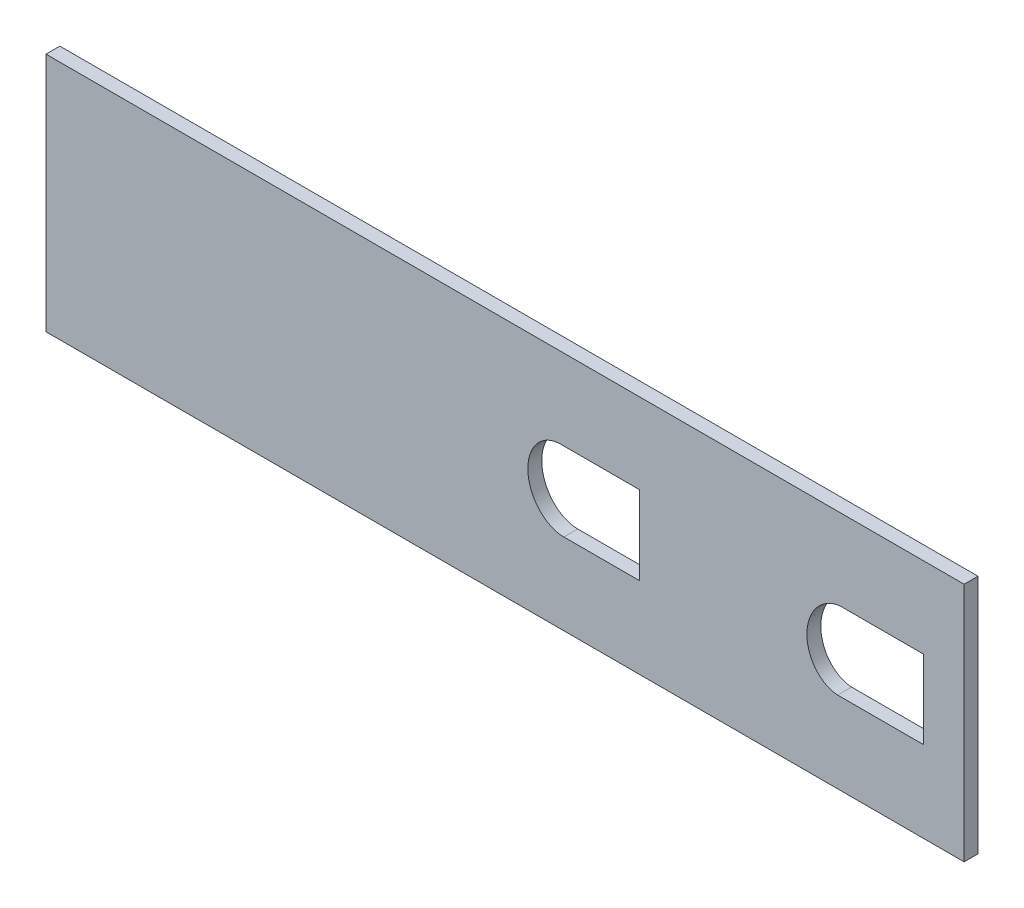
ISO-10303-21;
HEADER;
FILE_DESCRIPTION(('STEP AP214'),'2;1');
FILE_NAME('part.step','',(''),(''),'','','');
FILE_SCHEMA(('AUTOMOTIVE_DESIGN { 1 0 10303 214 1 1 1 1 }'));
ENDSEC;
DATA;
#1=APPLICATION_CONTEXT('core data for automotive mechanical design processes');
#2=APPLICATION_PROTOCOL_DEFINITION('international standard','automotive_design',2000,#1);
#3=PRODUCT_CONTEXT('',#1,'mechanical');
#4=PRODUCT('Part','Part','',(#3));
#5=PRODUCT_RELATED_PRODUCT_CATEGORY('part','',(#4));
#6=PRODUCT_DEFINITION_FORMATION('','',#4);
#7=PRODUCT_DEFINITION_CONTEXT('part definition',#1,'design');
#8=PRODUCT_DEFINITION('design','',#6,#7);
#9=PRODUCT_DEFINITION_SHAPE('','',#8);
#10=(LENGTH_UNIT() NAMED_UNIT(*) SI_UNIT(.MILLI.,.METRE.));
#11=(NAMED_UNIT(*) PLANE_ANGLE_UNIT() SI_UNIT($,.RADIAN.));
#12=(NAMED_UNIT(*) SI_UNIT($,.STERADIAN.) SOLID_ANGLE_UNIT());
#13=UNCERTAINTY_MEASURE_WITH_UNIT(LENGTH_MEASURE(1.E-05),#10,'distance_accuracy_value','');
#14=(GEOMETRIC_REPRESENTATION_CONTEXT(3) GLOBAL_UNCERTAINTY_ASSIGNED_CONTEXT((#13)) GLOBAL_UNIT_ASSIGNED_CONTEXT((#10,
#11,#12)) REPRESENTATION_CONTEXT('',''));
#15=CARTESIAN_POINT('',(0.,0.,0.));
#16=DIRECTION('',(0.,0.,1.));
#17=DIRECTION('',(1.,0.,0.));
#18=AXIS2_PLACEMENT_3D('',#15,#16,#17);
#19=CARTESIAN_POINT('',(0.,0.,3.175));
#20=DIRECTION('',(0.,0.,1.));
#21=DIRECTION('',(1.,0.,0.));
#22=AXIS2_PLACEMENT_3D('',#19,#20,#21);
#23=PLANE('',#22);
#24=DIRECTION('',(0.,-1.,0.));
#25=VECTOR('',#24,1.);
#26=CARTESIAN_POINT('',(-366.588298269724,9.05831085311452,3.175));
#27=LINE('',#26,#25);
#28=CARTESIAN_POINT('',(-366.588298269724,9.05831085311452,3.175));
#29=VERTEX_POINT('',#28);
#30=CARTESIAN_POINT('',(-366.588298269724,-45.9416891468855,3.175));
#31=VERTEX_POINT('',#30);
#32=EDGE_CURVE('E230',#29,#31,#27,.T.);
#33=ORIENTED_EDGE('',*,*,#32,.T.);
#34=DIRECTION('',(1.,0.,0.));
#35=VECTOR('',#34,1.);
#36=CARTESIAN_POINT('',(-366.588298269724,-45.9416891468855,3.175));
#37=LINE('',#36,#35);
#38=CARTESIAN_POINT('',(-156.588298269724,-45.9416891468855,3.175));
#39=VERTEX_POINT('',#38);
#40=EDGE_CURVE('E243',#31,#39,#37,.T.);
#41=ORIENTED_EDGE('',*,*,#40,.T.);
#42=DIRECTION('',(0.,1.,0.));
#43=VECTOR('',#42,1.);
#44=CARTESIAN_POINT('',(-156.588298269724,9.05831085311455,3.175));
#45=LINE('',#44,#43);
#46=CARTESIAN_POINT('',(-156.588298269724,9.05831085311455,3.175));
#47=VERTEX_POINT('',#46);
#48=EDGE_CURVE('E224',#39,#47,#45,.T.);
#49=ORIENTED_EDGE('',*,*,#48,.T.);
#50=DIRECTION('',(-1.,0.,0.));
#51=VECTOR('',#50,1.);
#52=CARTESIAN_POINT('',(-366.588298269724,9.05831085311452,3.175));
#53=LINE('',#52,#51);
#54=EDGE_CURVE('E237',#47,#29,#53,.T.);
#55=ORIENTED_EDGE('',*,*,#54,.T.);
#56=EDGE_LOOP('',(#33,#41,#49,#55));
#57=FACE_BOUND('',#56,.T.);
#58=DIRECTION('',(1.,0.,0.));
#59=VECTOR('',#58,1.);
#60=CARTESIAN_POINT('',(-165.825906921968,-27.3596825358783,3.175));
#61=LINE('',#60,#59);
#62=CARTESIAN_POINT('',(-185.498112528018,-27.3596825358783,3.175));
#63=VERTEX_POINT('',#62);
#64=CARTESIAN_POINT('',(-165.825906921968,-27.3596825358783,3.175));
#65=VERTEX_POINT('',#64);
#66=EDGE_CURVE('E175',#63,#65,#61,.T.);
#67=ORIENTED_EDGE('',*,*,#66,.F.);
#68=CARTESIAN_POINT('',(-183.82600512815,-9.43762627900424,3.175));
#69=CARTESIAN_POINT('',(-184.381626607093,-9.3976877190397,3.175));
#70=CARTESIAN_POINT('',(-184.930515995652,-9.42483503394392,3.175));
#71=CARTESIAN_POINT('',(-186.015461991202,-9.60700946475767,3.175));
#72=CARTESIAN_POINT('',(-186.55468923459,-9.76487740277179,3.175));
#73=CARTESIAN_POINT('',(-187.316224975167,-10.0827047791657,3.175));
#74=CARTESIAN_POINT('',(-187.563814733712,-10.2023326238669,3.175));
#75=CARTESIAN_POINT('',(-188.046959470164,-10.4679172917623,3.175));
#76=CARTESIAN_POINT('',(-188.283591246519,-10.6146532163173,3.175));
#77=CARTESIAN_POINT('',(-188.967244504561,-11.0880994772463,3.175));
#78=CARTESIAN_POINT('',(-189.385834671062,-11.4451532324852,3.175));
#79=CARTESIAN_POINT('',(-190.155876140981,-12.2340640435901,3.175));
#80=CARTESIAN_POINT('',(-190.507940945727,-12.6685060868446,3.175));
#81=CARTESIAN_POINT('',(-191.1243492632,-13.5796209281931,3.175));
#82=CARTESIAN_POINT('',(-191.392257861304,-14.0594522395769,3.175));
#83=CARTESIAN_POINT('',(-191.735229160199,-14.8146752788922,3.175));
#84=CARTESIAN_POINT('',(-191.839717206272,-15.0728043894434,3.175));
#85=CARTESIAN_POINT('',(-192.025673908438,-15.5922309114728,3.175));
#86=CARTESIAN_POINT('',(-192.107659089232,-15.8545617787205,3.175));
#87=CARTESIAN_POINT('',(-192.321609274542,-16.6491752414127,3.175));
#88=CARTESIAN_POINT('',(-192.421750283607,-17.1890355134204,3.175));
#89=CARTESIAN_POINT('',(-192.508320776969,-18.0139796147588,3.175));
#90=CARTESIAN_POINT('',(-192.5264496794,-18.2916278624961,3.175));
#91=CARTESIAN_POINT('',(-192.540341709365,-18.8424309209239,3.175));
#92=CARTESIAN_POINT('',(-192.536260586708,-19.1167856485607,3.175));
#93=CARTESIAN_POINT('',(-192.490788713883,-19.9366954633639,3.175));
#94=CARTESIAN_POINT('',(-192.416446167164,-20.4791224502265,3.175));
#95=CARTESIAN_POINT('',(-192.234051872117,-21.2860342765934,3.175));
#96=CARTESIAN_POINT('',(-192.160881012469,-21.5551925624767,3.175));
#97=CARTESIAN_POINT('',(-191.992478643506,-22.0811289126585,3.175));
#98=CARTESIAN_POINT('',(-191.897215209672,-22.3386327619648,3.175));
#99=CARTESIAN_POINT('',(-191.578152340301,-23.0947089408419,3.175));
#100=CARTESIAN_POINT('',(-191.321465438144,-23.5770361265796,3.175));
#101=CARTESIAN_POINT('',(-190.864095629699,-24.2647939961027,3.175));
#102=CARTESIAN_POINT('',(-190.698255397334,-24.4894667964201,3.175));
#103=CARTESIAN_POINT('',(-190.347004112485,-24.9172218288641,3.175));
#104=CARTESIAN_POINT('',(-190.1618794335,-25.1203290672043,3.175));
#105=CARTESIAN_POINT('',(-189.577727685681,-25.6970217949708,3.175));
#106=CARTESIAN_POINT('',(-189.150303694519,-26.0384100460214,3.175));
#107=CARTESIAN_POINT('',(-188.444997142431,-26.4777340100719,3.175));
#108=CARTESIAN_POINT('',(-188.199013121392,-26.6115925506904,3.175));
#109=CARTESIAN_POINT('',(-187.699838217374,-26.8456248371998,3.175));
#110=CARTESIAN_POINT('',(-187.189859793686,-27.0483935371301,3.175));
#111=CARTESIAN_POINT('',(-186.658261328081,-27.1885974366089,3.175));
#112=CARTESIAN_POINT('',(-186.115554077769,-27.2966543633341,3.175));
#113=CARTESIAN_POINT('',(-185.837627103115,-27.3344436795835,3.175));
#114=CARTESIAN_POINT('',(-185.540644375799,-27.3567769033788,3.175));
#115=CARTESIAN_POINT('',(-185.51937734486,-27.3582786059454,3.175));
#116=CARTESIAN_POINT('',(-185.498112528018,-27.3596825358783,3.175));
#117=B_SPLINE_CURVE_WITH_KNOTS('',3,(#68,#69,#70,#71,#72,#73,#74,#75,#76,#77,#78,#79,#80,#81,
#82,#83,#84,#85,#86,#87,#88,#89,#90,#91,#92,#93,#94,#95,#96,#97,#98,#99,#100,#101,#102,#103,
#104,#105,#106,#107,#108,#109,#110,#111,#112,#113,#114,#115,#116),.UNSPECIFIED.,.F.,.F.,(4,2,2,
2,2,2,2,2,2,2,2,2,2,2,2,2,2,2,2,2,2,1,2,2,4),(0.,0.0312499999999989,0.0624999999999977,
0.0781249999999973,0.093749999999997,0.124999999999997,0.156249999999998,0.187499999999998,
0.203124999999999,0.218749999999999,0.25,0.265625000000001,0.281250000000001,0.312500000000002,
0.328125000000002,0.343750000000003,0.375000000000005,0.390625000000005,0.406250000000006,
0.437500000000008,0.453125000000008,0.468750000000009,0.484375000000009,0.50000000000001,
0.501205352540777),.UNSPECIFIED.);
#118=CARTESIAN_POINT('',(-183.82600512815,-9.43762627900424,3.175));
#119=VERTEX_POINT('',#118);
#120=EDGE_CURVE('E170',#119,#63,#117,.T.);
#121=ORIENTED_EDGE('',*,*,#120,.F.);
#122=DIRECTION('',(-1.,0.,0.));
#123=VECTOR('',#122,1.);
#124=CARTESIAN_POINT('',(-183.82600512815,-9.43762627900424,3.175));
#125=LINE('',#124,#123);
#126=CARTESIAN_POINT('',(-165.825906921968,-9.43762627900424,3.175));
#127=VERTEX_POINT('',#126);
#128=EDGE_CURVE('E265',#127,#119,#125,.T.);
#129=ORIENTED_EDGE('',*,*,#128,.F.);
#130=DIRECTION('',(0.,1.,0.));
#131=VECTOR('',#130,1.);
#132=CARTESIAN_POINT('',(-165.825906921968,-9.43762627900424,3.175));
#133=LINE('',#132,#131);
#134=EDGE_CURVE('E262',#65,#127,#133,.T.);
#135=ORIENTED_EDGE('',*,*,#134,.F.);
#136=EDGE_LOOP('',(#67,#121,#129,#135));
#137=FACE_BOUND('',#136,.T.);
#138=DIRECTION('',(1.,0.,0.));
#139=VECTOR('',#138,1.);
#140=CARTESIAN_POINT('',(-230.842639606397,-27.3595694212988,3.175));
#141=LINE('',#140,#139);
#142=CARTESIAN_POINT('',(-248.122030425749,-27.3595694212988,3.175));
#143=VERTEX_POINT('',#142);
#144=CARTESIAN_POINT('',(-230.842639606397,-27.3595694212988,3.175));
#145=VERTEX_POINT('',#144);
#146=EDGE_CURVE('E134',#143,#145,#141,.T.);
#147=ORIENTED_EDGE('',*,*,#146,.F.);
#148=CARTESIAN_POINT('',(-248.842639606397,-9.34526811980848,3.175));
#149=CARTESIAN_POINT('',(-249.008492971074,-9.34526811980872,3.175));
#150=CARTESIAN_POINT('',(-249.174528911602,-9.35121721735225,3.175));
#151=CARTESIAN_POINT('',(-249.89789273651,-9.4031482934177,3.175));
#152=CARTESIAN_POINT('',(-250.439041217788,-9.5087913489933,3.175));
#153=CARTESIAN_POINT('',(-251.226902991406,-9.76427711693536,3.175));
#154=CARTESIAN_POINT('',(-251.486942339155,-9.86638963149958,3.175));
#155=CARTESIAN_POINT('',(-251.99189871818,-10.1008834673623,3.175));
#156=CARTESIAN_POINT('',(-252.478538382804,-10.3636674117562,3.175));
#157=CARTESIAN_POINT('',(-252.930635603864,-10.6798020529985,3.175));
#158=CARTESIAN_POINT('',(-253.365916766493,-11.0219090442841,3.175));
#159=CARTESIAN_POINT('',(-253.576181815946,-11.2070746349716,3.175));
#160=CARTESIAN_POINT('',(-254.170571266035,-11.7902063920366,3.175));
#161=CARTESIAN_POINT('',(-254.521054547173,-12.2164086816258,3.175));
#162=CARTESIAN_POINT('',(-254.984007031448,-12.9070637117029,3.175));
#163=CARTESIAN_POINT('',(-255.128207338842,-13.1469263186751,3.175));
#164=CARTESIAN_POINT('',(-255.391039984974,-13.6351319569444,3.175));
#165=CARTESIAN_POINT('',(-255.510280091706,-13.8842000215914,3.175));
#166=CARTESIAN_POINT('',(-255.833281598636,-14.6455619330882,3.175));
#167=CARTESIAN_POINT('',(-256.003111783134,-15.174210606256,3.175));
#168=CARTESIAN_POINT('',(-256.25011317257,-16.2584003483592,3.175));
#169=CARTESIAN_POINT('',(-256.325565616856,-16.804580712654,3.175));
#170=CARTESIAN_POINT('',(-256.371925399497,-17.6295327999595,3.175));
#171=CARTESIAN_POINT('',(-256.37617068135,-17.9054698319737,3.175));
#172=CARTESIAN_POINT('',(-256.362395822802,-18.4592371019221,3.175));
#173=CARTESIAN_POINT('',(-256.344221578809,-18.7379736365194,3.175));
#174=CARTESIAN_POINT('',(-256.257616037898,-19.5642495459919,3.175));
#175=CARTESIAN_POINT('',(-256.157308420975,-20.1052245457878,3.175));
#176=CARTESIAN_POINT('',(-255.942745345631,-20.9018166225572,3.175));
#177=CARTESIAN_POINT('',(-255.860495562724,-21.1648584371339,3.175));
#178=CARTESIAN_POINT('',(-255.673862588316,-21.6858075159791,3.175));
#179=CARTESIAN_POINT('',(-255.568906935041,-21.9448494274623,3.175));
#180=CARTESIAN_POINT('',(-255.224992288693,-22.70149766678,3.175));
#181=CARTESIAN_POINT('',(-254.956918189479,-23.1810175992367,3.175));
#182=CARTESIAN_POINT('',(-254.496021760085,-23.8625510991662,3.175));
#183=CARTESIAN_POINT('',(-254.332533090111,-24.0833999945349,3.175));
#184=CARTESIAN_POINT('',(-253.984921715629,-24.5118485417914,3.175));
#185=CARTESIAN_POINT('',(-253.799889309762,-24.7203724492883,3.175));
#186=CARTESIAN_POINT('',(-253.217915831476,-25.3179180375403,3.175));
#187=CARTESIAN_POINT('',(-252.799712481649,-25.674443478179,3.175));
#188=CARTESIAN_POINT('',(-252.125292420281,-26.1440051309579,3.175));
#189=CARTESIAN_POINT('',(-251.892576916941,-26.2895766409284,3.175));
#190=CARTESIAN_POINT('',(-251.410235401699,-26.5573085907726,3.175));
#191=CARTESIAN_POINT('',(-251.158897377964,-26.680166876181,3.175));
#192=CARTESIAN_POINT('',(-250.389777097534,-27.0046460570001,3.175));
#193=CARTESIAN_POINT('',(-249.862976161123,-27.1610192469186,3.175));
#194=CARTESIAN_POINT('',(-249.050989853004,-27.3026577365939,3.175));
#195=CARTESIAN_POINT('',(-248.776672466168,-27.3342793229584,3.175));
#196=CARTESIAN_POINT('',(-248.373197760273,-27.3561891893873,3.175));
#197=CARTESIAN_POINT('',(-248.247527215474,-27.3595694212988,3.175));
#198=CARTESIAN_POINT('',(-248.122030425748,-27.3595694212988,3.175));
#199=B_SPLINE_CURVE_WITH_KNOTS('',3,(#148,#149,#150,#151,#152,#153,#154,#155,#156,#157,#158,
#159,#160,#161,#162,#163,#164,#165,#166,#167,#168,#169,#170,#171,#172,#173,#174,#175,#176,#177,
#178,#179,#180,#181,#182,#183,#184,#185,#186,#187,#188,#189,#190,#191,#192,#193,#194,#195,#196,
#197,#198),.UNSPECIFIED.,.F.,.F.,(4,2,2,2,1,2,2,2,2,2,2,2,2,2,2,2,2,2,2,2,2,2,2,2,2,4),
(0.990687446676566,1.,1.03124999999999,1.04687499999998,1.06249999999998,1.07812499999997,
1.09374999999997,1.12499999999996,1.14062499999996,1.15624999999995,1.18749999999994,
1.21874999999994,1.23437499999993,1.24999999999993,1.28124999999992,1.29687499999992,
1.31249999999991,1.34374999999991,1.3593749999999,1.3749999999999,1.4062499999999,
1.42187499999989,1.43749999999989,1.46874999999989,1.4843749999999,1.49141188221113),.UNSPECIFIED.);
#200=CARTESIAN_POINT('',(-248.842639606397,-9.34526811980848,3.175));
#201=VERTEX_POINT('',#200);
#202=EDGE_CURVE('E126',#201,#143,#199,.T.);
#203=ORIENTED_EDGE('',*,*,#202,.F.);
#204=DIRECTION('',(-1.,0.,0.));
#205=VECTOR('',#204,1.);
#206=CARTESIAN_POINT('',(-248.842639606397,-9.34526811980848,3.175));
#207=LINE('',#206,#205);
#208=CARTESIAN_POINT('',(-230.842639606397,-9.34526811980848,3.175));
#209=VERTEX_POINT('',#208);
#210=EDGE_CURVE('E148',#209,#201,#207,.T.);
#211=ORIENTED_EDGE('',*,*,#210,.F.);
#212=DIRECTION('',(0.,1.,0.));
#213=VECTOR('',#212,1.);
#214=CARTESIAN_POINT('',(-230.842639606397,-9.34526811980848,3.175));
#215=LINE('',#214,#213);
#216=EDGE_CURVE('E146',#145,#209,#215,.T.);
#217=ORIENTED_EDGE('',*,*,#216,.F.);
#218=EDGE_LOOP('',(#147,#203,#211,#217));
#219=FACE_BOUND('',#218,.T.);
#220=ADVANCED_FACE('F37',(#57,#137,#219),#23,.T.);
#221=CARTESIAN_POINT('',(0.,0.,0.));
#222=DIRECTION('',(0.,0.,1.));
#223=DIRECTION('',(1.,0.,0.));
#224=AXIS2_PLACEMENT_3D('',#221,#222,#223);
#225=PLANE('',#224);
#226=CARTESIAN_POINT('',(-183.82600512815,-9.43762627900424,0.));
#227=CARTESIAN_POINT('',(-184.381626607093,-9.3976877190397,0.));
#228=CARTESIAN_POINT('',(-184.930515995652,-9.42483503394392,0.));
#229=CARTESIAN_POINT('',(-186.015461991202,-9.60700946475767,0.));
#230=CARTESIAN_POINT('',(-186.55468923459,-9.76487740277179,0.));
#231=CARTESIAN_POINT('',(-187.316224975167,-10.0827047791657,0.));
#232=CARTESIAN_POINT('',(-187.563814733712,-10.2023326238669,0.));
#233=CARTESIAN_POINT('',(-188.046959470164,-10.4679172917623,0.));
#234=CARTESIAN_POINT('',(-188.283591246519,-10.6146532163173,0.));
#235=CARTESIAN_POINT('',(-188.967244504561,-11.0880994772463,0.));
#236=CARTESIAN_POINT('',(-189.385834671062,-11.4451532324852,0.));
#237=CARTESIAN_POINT('',(-190.155876140981,-12.2340640435901,0.));
#238=CARTESIAN_POINT('',(-190.507940945727,-12.6685060868446,0.));
#239=CARTESIAN_POINT('',(-191.1243492632,-13.5796209281931,0.));
#240=CARTESIAN_POINT('',(-191.392257861304,-14.0594522395769,0.));
#241=CARTESIAN_POINT('',(-191.735229160199,-14.8146752788922,0.));
#242=CARTESIAN_POINT('',(-191.839717206272,-15.0728043894434,0.));
#243=CARTESIAN_POINT('',(-192.025673908438,-15.5922309114728,0.));
#244=CARTESIAN_POINT('',(-192.107659089232,-15.8545617787205,0.));
#245=CARTESIAN_POINT('',(-192.321609274542,-16.6491752414127,0.));
#246=CARTESIAN_POINT('',(-192.421750283607,-17.1890355134204,0.));
#247=CARTESIAN_POINT('',(-192.508320776969,-18.0139796147588,0.));
#248=CARTESIAN_POINT('',(-192.5264496794,-18.2916278624961,0.));
#249=CARTESIAN_POINT('',(-192.540341709365,-18.8424309209239,0.));
#250=CARTESIAN_POINT('',(-192.536260586708,-19.1167856485607,0.));
#251=CARTESIAN_POINT('',(-192.490788713883,-19.9366954633639,0.));
#252=CARTESIAN_POINT('',(-192.416446167164,-20.4791224502265,0.));
#253=CARTESIAN_POINT('',(-192.234051872117,-21.2860342765934,0.));
#254=CARTESIAN_POINT('',(-192.160881012469,-21.5551925624767,0.));
#255=CARTESIAN_POINT('',(-191.992478643506,-22.0811289126585,0.));
#256=CARTESIAN_POINT('',(-191.897215209672,-22.3386327619648,0.));
#257=CARTESIAN_POINT('',(-191.578152340301,-23.0947089408419,0.));
#258=CARTESIAN_POINT('',(-191.321465438144,-23.5770361265796,0.));
#259=CARTESIAN_POINT('',(-190.864095629699,-24.2647939961027,0.));
#260=CARTESIAN_POINT('',(-190.698255397334,-24.4894667964201,0.));
#261=CARTESIAN_POINT('',(-190.347004112485,-24.9172218288641,0.));
#262=CARTESIAN_POINT('',(-190.1618794335,-25.1203290672043,0.));
#263=CARTESIAN_POINT('',(-189.577727685681,-25.6970217949708,0.));
#264=CARTESIAN_POINT('',(-189.150303694519,-26.0384100460214,0.));
#265=CARTESIAN_POINT('',(-188.444997142431,-26.4777340100719,0.));
#266=CARTESIAN_POINT('',(-188.199013121392,-26.6115925506904,0.));
#267=CARTESIAN_POINT('',(-187.699838217374,-26.8456248371998,0.));
#268=CARTESIAN_POINT('',(-187.189859793686,-27.0483935371301,0.));
#269=CARTESIAN_POINT('',(-186.658261328081,-27.1885974366089,0.));
#270=CARTESIAN_POINT('',(-186.115554077769,-27.2966543633341,0.));
#271=CARTESIAN_POINT('',(-185.837627103115,-27.3344436795835,0.));
#272=CARTESIAN_POINT('',(-185.540644375799,-27.3567769033788,0.));
#273=CARTESIAN_POINT('',(-185.51937734486,-27.3582786059454,0.));
#274=CARTESIAN_POINT('',(-185.498112528018,-27.3596825358783,0.));
#275=B_SPLINE_CURVE_WITH_KNOTS('',3,(#226,#227,#228,#229,#230,#231,#232,#233,#234,#235,#236,
#237,#238,#239,#240,#241,#242,#243,#244,#245,#246,#247,#248,#249,#250,#251,#252,#253,#254,#255,
#256,#257,#258,#259,#260,#261,#262,#263,#264,#265,#266,#267,#268,#269,#270,#271,#272,#273,#274),
.UNSPECIFIED.,.F.,.F.,(4,2,2,2,2,2,2,2,2,2,2,2,2,2,2,2,2,2,2,2,2,1,2,2,4),(0.,
0.0312499999999989,0.0624999999999977,0.0781249999999973,0.093749999999997,0.124999999999997,
0.156249999999998,0.187499999999998,0.203124999999999,0.218749999999999,0.25,0.265625000000001,
0.281250000000001,0.312500000000002,0.328125000000002,0.343750000000003,0.375000000000005,
0.390625000000005,0.406250000000006,0.437500000000008,0.453125000000008,0.468750000000009,
0.484375000000009,0.50000000000001,0.501205352540777),.UNSPECIFIED.);
#276=CARTESIAN_POINT('',(-183.82600512815,-9.43762627900424,0.));
#277=VERTEX_POINT('',#276);
#278=CARTESIAN_POINT('',(-185.498112528018,-27.3596825358783,0.));
#279=VERTEX_POINT('',#278);
#280=EDGE_CURVE('E142',#277,#279,#275,.T.);
#281=ORIENTED_EDGE('',*,*,#280,.T.);
#282=DIRECTION('',(1.,0.,0.));
#283=VECTOR('',#282,1.);
#284=CARTESIAN_POINT('',(-165.825906921968,-27.3596825358783,0.));
#285=LINE('',#284,#283);
#286=CARTESIAN_POINT('',(-165.825906921968,-27.3596825358783,0.));
#287=VERTEX_POINT('',#286);
#288=EDGE_CURVE('E273',#279,#287,#285,.T.);
#289=ORIENTED_EDGE('',*,*,#288,.T.);
#290=DIRECTION('',(0.,1.,0.));
#291=VECTOR('',#290,1.);
#292=CARTESIAN_POINT('',(-165.825906921968,-9.43762627900424,0.));
#293=LINE('',#292,#291);
#294=CARTESIAN_POINT('',(-165.825906921968,-9.43762627900424,0.));
#295=VERTEX_POINT('',#294);
#296=EDGE_CURVE('E279',#287,#295,#293,.T.);
#297=ORIENTED_EDGE('',*,*,#296,.T.);
#298=DIRECTION('',(-1.,0.,0.));
#299=VECTOR('',#298,1.);
#300=CARTESIAN_POINT('',(-183.82600512815,-9.43762627900424,0.));
#301=LINE('',#300,#299);
#302=EDGE_CURVE('E176',#295,#277,#301,.T.);
#303=ORIENTED_EDGE('',*,*,#302,.T.);
#304=EDGE_LOOP('',(#281,#289,#297,#303));
#305=FACE_BOUND('',#304,.T.);
#306=DIRECTION('',(0.,-1.,0.));
#307=VECTOR('',#306,1.);
#308=CARTESIAN_POINT('',(-366.588298269724,9.05831085311452,0.));
#309=LINE('',#308,#307);
#310=CARTESIAN_POINT('',(-366.588298269724,9.05831085311452,0.));
#311=VERTEX_POINT('',#310);
#312=CARTESIAN_POINT('',(-366.588298269724,-45.9416891468855,0.));
#313=VERTEX_POINT('',#312);
#314=EDGE_CURVE('E220',#311,#313,#309,.T.);
#315=ORIENTED_EDGE('',*,*,#314,.F.);
#316=DIRECTION('',(-1.,0.,0.));
#317=VECTOR('',#316,1.);
#318=CARTESIAN_POINT('',(-366.588298269724,9.05831085311452,0.));
#319=LINE('',#318,#317);
#320=CARTESIAN_POINT('',(-156.588298269724,9.05831085311455,0.));
#321=VERTEX_POINT('',#320);
#322=EDGE_CURVE('E228',#321,#311,#319,.T.);
#323=ORIENTED_EDGE('',*,*,#322,.F.);
#324=DIRECTION('',(0.,1.,0.));
#325=VECTOR('',#324,1.);
#326=CARTESIAN_POINT('',(-156.588298269724,9.05831085311455,0.));
#327=LINE('',#326,#325);
#328=CARTESIAN_POINT('',(-156.588298269724,-45.9416891468855,0.));
#329=VERTEX_POINT('',#328);
#330=EDGE_CURVE('E219',#329,#321,#327,.T.);
#331=ORIENTED_EDGE('',*,*,#330,.F.);
#332=DIRECTION('',(1.,0.,0.));
#333=VECTOR('',#332,1.);
#334=CARTESIAN_POINT('',(-366.588298269724,-45.9416891468855,0.));
#335=LINE('',#334,#333);
#336=EDGE_CURVE('E211',#313,#329,#335,.T.);
#337=ORIENTED_EDGE('',*,*,#336,.F.);
#338=EDGE_LOOP('',(#315,#323,#331,#337));
#339=FACE_BOUND('',#338,.T.);
#340=CARTESIAN_POINT('',(-248.842639606397,-9.34526811980848,0.));
#341=CARTESIAN_POINT('',(-249.008492971074,-9.34526811980872,0.));
#342=CARTESIAN_POINT('',(-249.174528911602,-9.35121721735225,0.));
#343=CARTESIAN_POINT('',(-249.89789273651,-9.4031482934177,0.));
#344=CARTESIAN_POINT('',(-250.439041217788,-9.5087913489933,0.));
#345=CARTESIAN_POINT('',(-251.226902991406,-9.76427711693536,0.));
#346=CARTESIAN_POINT('',(-251.486942339155,-9.86638963149958,0.));
#347=CARTESIAN_POINT('',(-251.99189871818,-10.1008834673623,0.));
#348=CARTESIAN_POINT('',(-252.478538382804,-10.3636674117562,0.));
#349=CARTESIAN_POINT('',(-252.930635603864,-10.6798020529985,0.));
#350=CARTESIAN_POINT('',(-253.365916766493,-11.0219090442841,0.));
#351=CARTESIAN_POINT('',(-253.576181815946,-11.2070746349716,0.));
#352=CARTESIAN_POINT('',(-254.170571266035,-11.7902063920366,0.));
#353=CARTESIAN_POINT('',(-254.521054547173,-12.2164086816258,0.));
#354=CARTESIAN_POINT('',(-254.984007031448,-12.9070637117029,0.));
#355=CARTESIAN_POINT('',(-255.128207338842,-13.1469263186751,0.));
#356=CARTESIAN_POINT('',(-255.391039984974,-13.6351319569444,0.));
#357=CARTESIAN_POINT('',(-255.510280091706,-13.8842000215914,0.));
#358=CARTESIAN_POINT('',(-255.833281598636,-14.6455619330882,0.));
#359=CARTESIAN_POINT('',(-256.003111783134,-15.174210606256,0.));
#360=CARTESIAN_POINT('',(-256.25011317257,-16.2584003483592,0.));
#361=CARTESIAN_POINT('',(-256.325565616856,-16.804580712654,0.));
#362=CARTESIAN_POINT('',(-256.371925399497,-17.6295327999595,0.));
#363=CARTESIAN_POINT('',(-256.37617068135,-17.9054698319737,0.));
#364=CARTESIAN_POINT('',(-256.362395822802,-18.4592371019221,0.));
#365=CARTESIAN_POINT('',(-256.344221578809,-18.7379736365194,0.));
#366=CARTESIAN_POINT('',(-256.257616037898,-19.5642495459919,0.));
#367=CARTESIAN_POINT('',(-256.157308420975,-20.1052245457878,0.));
#368=CARTESIAN_POINT('',(-255.942745345631,-20.9018166225572,0.));
#369=CARTESIAN_POINT('',(-255.860495562724,-21.1648584371339,0.));
#370=CARTESIAN_POINT('',(-255.673862588316,-21.6858075159791,0.));
#371=CARTESIAN_POINT('',(-255.568906935041,-21.9448494274623,0.));
#372=CARTESIAN_POINT('',(-255.224992288693,-22.70149766678,0.));
#373=CARTESIAN_POINT('',(-254.956918189479,-23.1810175992367,0.));
#374=CARTESIAN_POINT('',(-254.496021760085,-23.8625510991662,0.));
#375=CARTESIAN_POINT('',(-254.332533090111,-24.0833999945349,0.));
#376=CARTESIAN_POINT('',(-253.984921715629,-24.5118485417914,0.));
#377=CARTESIAN_POINT('',(-253.799889309762,-24.7203724492883,0.));
#378=CARTESIAN_POINT('',(-253.217915831476,-25.3179180375403,0.));
#379=CARTESIAN_POINT('',(-252.799712481649,-25.674443478179,0.));
#380=CARTESIAN_POINT('',(-252.125292420281,-26.1440051309579,0.));
#381=CARTESIAN_POINT('',(-251.892576916941,-26.2895766409284,0.));
#382=CARTESIAN_POINT('',(-251.410235401699,-26.5573085907726,0.));
#383=CARTESIAN_POINT('',(-251.158897377964,-26.680166876181,0.));
#384=CARTESIAN_POINT('',(-250.389777097534,-27.0046460570001,0.));
#385=CARTESIAN_POINT('',(-249.862976161123,-27.1610192469186,0.));
#386=CARTESIAN_POINT('',(-249.050989853004,-27.3026577365939,0.));
#387=CARTESIAN_POINT('',(-248.776672466168,-27.3342793229584,0.));
#388=CARTESIAN_POINT('',(-248.373197760273,-27.3561891893873,0.));
#389=CARTESIAN_POINT('',(-248.247527215474,-27.3595694212988,0.));
#390=CARTESIAN_POINT('',(-248.122030425748,-27.3595694212988,0.));
#391=B_SPLINE_CURVE_WITH_KNOTS('',3,(#340,#341,#342,#343,#344,#345,#346,#347,#348,#349,#350,
#351,#352,#353,#354,#355,#356,#357,#358,#359,#360,#361,#362,#363,#364,#365,#366,#367,#368,#369,
#370,#371,#372,#373,#374,#375,#376,#377,#378,#379,#380,#381,#382,#383,#384,#385,#386,#387,#388,
#389,#390),.UNSPECIFIED.,.F.,.F.,(4,2,2,2,1,2,2,2,2,2,2,2,2,2,2,2,2,2,2,2,2,2,2,2,2,4),
(0.990687446676566,1.,1.03124999999999,1.04687499999998,1.06249999999998,1.07812499999997,
1.09374999999997,1.12499999999996,1.14062499999996,1.15624999999995,1.18749999999994,
1.21874999999994,1.23437499999993,1.24999999999993,1.28124999999992,1.29687499999992,
1.31249999999991,1.34374999999991,1.3593749999999,1.3749999999999,1.4062499999999,
1.42187499999989,1.43749999999989,1.46874999999989,1.4843749999999,1.49141188221113),.UNSPECIFIED.);
#392=CARTESIAN_POINT('',(-248.842639606397,-9.34526811980848,0.));
#393=VERTEX_POINT('',#392);
#394=CARTESIAN_POINT('',(-248.122030425749,-27.3595694212988,0.));
#395=VERTEX_POINT('',#394);
#396=EDGE_CURVE('E60',#393,#395,#391,.T.);
#397=ORIENTED_EDGE('',*,*,#396,.T.);
#398=DIRECTION('',(1.,0.,0.));
#399=VECTOR('',#398,1.);
#400=CARTESIAN_POINT('',(-230.842639606397,-27.3595694212988,0.));
#401=LINE('',#400,#399);
#402=CARTESIAN_POINT('',(-230.842639606397,-27.3595694212988,0.));
#403=VERTEX_POINT('',#402);
#404=EDGE_CURVE('E141',#395,#403,#401,.T.);
#405=ORIENTED_EDGE('',*,*,#404,.T.);
#406=DIRECTION('',(0.,1.,0.));
#407=VECTOR('',#406,1.);
#408=CARTESIAN_POINT('',(-230.842639606397,-9.34526811980848,0.));
#409=LINE('',#408,#407);
#410=CARTESIAN_POINT('',(-230.842639606397,-9.34526811980848,0.));
#411=VERTEX_POINT('',#410);
#412=EDGE_CURVE('E162',#403,#411,#409,.T.);
#413=ORIENTED_EDGE('',*,*,#412,.T.);
#414=DIRECTION('',(-1.,0.,0.));
#415=VECTOR('',#414,1.);
#416=CARTESIAN_POINT('',(-248.842639606397,-9.34526811980848,0.));
#417=LINE('',#416,#415);
#418=EDGE_CURVE('E135',#411,#393,#417,.T.);
#419=ORIENTED_EDGE('',*,*,#418,.T.);
#420=EDGE_LOOP('',(#397,#405,#413,#419));
#421=FACE_BOUND('',#420,.T.);
#422=ADVANCED_FACE('F192',(#305,#339,#421),#225,.F.);
#423=CARTESIAN_POINT('',(-366.588298269724,9.05831085311452,3.175));
#424=DIRECTION('',(1.,0.,0.));
#425=DIRECTION('',(0.,0.,-1.));
#426=AXIS2_PLACEMENT_3D('',#423,#424,#425);
#427=PLANE('',#426);
#428=ORIENTED_EDGE('',*,*,#314,.T.);
#429=DIRECTION('',(0.,0.,-1.));
#430=VECTOR('',#429,1.);
#431=CARTESIAN_POINT('',(-366.588298269724,-45.9416891468855,3.175));
#432=LINE('',#431,#430);
#433=EDGE_CURVE('E11',#31,#313,#432,.T.);
#434=ORIENTED_EDGE('',*,*,#433,.F.);
#435=ORIENTED_EDGE('',*,*,#32,.F.);
#436=DIRECTION('',(0.,0.,-1.));
#437=VECTOR('',#436,1.);
#438=CARTESIAN_POINT('',(-366.588298269724,9.05831085311452,3.175));
#439=LINE('',#438,#437);
#440=EDGE_CURVE('E234',#29,#311,#439,.T.);
#441=ORIENTED_EDGE('',*,*,#440,.T.);
#442=EDGE_LOOP('',(#428,#434,#435,#441));
#443=FACE_BOUND('',#442,.T.);
#444=ADVANCED_FACE('F39',(#443),#427,.F.);
#445=CARTESIAN_POINT('',(-366.588298269724,-45.9416891468855,3.175));
#446=DIRECTION('',(0.,1.,0.));
#447=DIRECTION('',(0.,0.,1.));
#448=AXIS2_PLACEMENT_3D('',#445,#446,#447);
#449=PLANE('',#448);
#450=ORIENTED_EDGE('',*,*,#336,.T.);
#451=DIRECTION('',(0.,0.,-1.));
#452=VECTOR('',#451,1.);
#453=CARTESIAN_POINT('',(-156.588298269724,-45.9416891468855,3.175));
#454=LINE('',#453,#452);
#455=EDGE_CURVE('E45',#39,#329,#454,.T.);
#456=ORIENTED_EDGE('',*,*,#455,.F.);
#457=ORIENTED_EDGE('',*,*,#40,.F.);
#458=ORIENTED_EDGE('',*,*,#433,.T.);
#459=EDGE_LOOP('',(#450,#456,#457,#458));
#460=FACE_BOUND('',#459,.T.);
#461=ADVANCED_FACE('F202',(#460),#449,.F.);
#462=CARTESIAN_POINT('',(-156.588298269724,9.05831085311455,3.175));
#463=DIRECTION('',(-1.,0.,0.));
#464=DIRECTION('',(0.,0.,1.));
#465=AXIS2_PLACEMENT_3D('',#462,#463,#464);
#466=PLANE('',#465);
#467=ORIENTED_EDGE('',*,*,#330,.T.);
#468=DIRECTION('',(0.,0.,-1.));
#469=VECTOR('',#468,1.);
#470=CARTESIAN_POINT('',(-156.588298269724,9.05831085311455,3.175));
#471=LINE('',#470,#469);
#472=EDGE_CURVE('E225',#47,#321,#471,.T.);
#473=ORIENTED_EDGE('',*,*,#472,.F.);
#474=ORIENTED_EDGE('',*,*,#48,.F.);
#475=ORIENTED_EDGE('',*,*,#455,.T.);
#476=EDGE_LOOP('',(#467,#473,#474,#475));
#477=FACE_BOUND('',#476,.T.);
#478=ADVANCED_FACE('F199',(#477),#466,.F.);
#479=CARTESIAN_POINT('',(-366.588298269724,9.05831085311452,3.175));
#480=DIRECTION('',(0.,-1.,0.));
#481=DIRECTION('',(1.,0.,0.));
#482=AXIS2_PLACEMENT_3D('',#479,#480,#481);
#483=PLANE('',#482);
#484=ORIENTED_EDGE('',*,*,#322,.T.);
#485=ORIENTED_EDGE('',*,*,#440,.F.);
#486=ORIENTED_EDGE('',*,*,#54,.F.);
#487=ORIENTED_EDGE('',*,*,#472,.T.);
#488=EDGE_LOOP('',(#484,#485,#486,#487));
#489=FACE_BOUND('',#488,.T.);
#490=ADVANCED_FACE('F187',(#489),#483,.F.);
#491=DIRECTION('',(0.,0.,-1.));
#492=VECTOR('',#491,1.);
#493=SURFACE_OF_LINEAR_EXTRUSION('',#117,#492);
#494=ORIENTED_EDGE('',*,*,#280,.F.);
#495=DIRECTION('',(0.,0.,-1.));
#496=VECTOR('',#495,1.);
#497=CARTESIAN_POINT('',(-183.82600512815,-9.43762627900424,3.175));
#498=LINE('',#497,#496);
#499=EDGE_CURVE('E267',#119,#277,#498,.T.);
#500=ORIENTED_EDGE('',*,*,#499,.F.);
#501=ORIENTED_EDGE('',*,*,#120,.T.);
#502=DIRECTION('',(0.,0.,-1.));
#503=VECTOR('',#502,1.);
#504=CARTESIAN_POINT('',(-185.498112528018,-27.3596825358783,3.175));
#505=LINE('',#504,#503);
#506=EDGE_CURVE('E246',#63,#279,#505,.T.);
#507=ORIENTED_EDGE('',*,*,#506,.T.);
#508=EDGE_LOOP('',(#494,#500,#501,#507));
#509=FACE_BOUND('',#508,.T.);
#510=ADVANCED_FACE('F182',(#509),#493,.T.);
#511=CARTESIAN_POINT('',(-165.825906921968,-27.3596825358783,3.175));
#512=DIRECTION('',(0.,1.,0.));
#513=DIRECTION('',(-1.,0.,0.));
#514=AXIS2_PLACEMENT_3D('',#511,#512,#513);
#515=PLANE('',#514);
#516=ORIENTED_EDGE('',*,*,#288,.F.);
#517=ORIENTED_EDGE('',*,*,#506,.F.);
#518=ORIENTED_EDGE('',*,*,#66,.T.);
#519=DIRECTION('',(0.,0.,-1.));
#520=VECTOR('',#519,1.);
#521=CARTESIAN_POINT('',(-165.825906921968,-27.3596825358783,3.175));
#522=LINE('',#521,#520);
#523=EDGE_CURVE('E248',#65,#287,#522,.T.);
#524=ORIENTED_EDGE('',*,*,#523,.T.);
#525=EDGE_LOOP('',(#516,#517,#518,#524));
#526=FACE_BOUND('',#525,.T.);
#527=ADVANCED_FACE('F186',(#526),#515,.T.);
#528=CARTESIAN_POINT('',(-165.825906921968,-9.43762627900424,3.175));
#529=DIRECTION('',(-1.,0.,0.));
#530=DIRECTION('',(0.,0.,1.));
#531=AXIS2_PLACEMENT_3D('',#528,#529,#530);
#532=PLANE('',#531);
#533=ORIENTED_EDGE('',*,*,#296,.F.);
#534=ORIENTED_EDGE('',*,*,#523,.F.);
#535=ORIENTED_EDGE('',*,*,#134,.T.);
#536=DIRECTION('',(0.,0.,-1.));
#537=VECTOR('',#536,1.);
#538=CARTESIAN_POINT('',(-165.825906921968,-9.43762627900424,3.175));
#539=LINE('',#538,#537);
#540=EDGE_CURVE('E252',#127,#295,#539,.T.);
#541=ORIENTED_EDGE('',*,*,#540,.T.);
#542=EDGE_LOOP('',(#533,#534,#535,#541));
#543=FACE_BOUND('',#542,.T.);
#544=ADVANCED_FACE('F287',(#543),#532,.T.);
#545=CARTESIAN_POINT('',(-183.82600512815,-9.43762627900424,3.175));
#546=DIRECTION('',(0.,-1.,0.));
#547=DIRECTION('',(0.,0.,-1.));
#548=AXIS2_PLACEMENT_3D('',#545,#546,#547);
#549=PLANE('',#548);
#550=ORIENTED_EDGE('',*,*,#302,.F.);
#551=ORIENTED_EDGE('',*,*,#540,.F.);
#552=ORIENTED_EDGE('',*,*,#128,.T.);
#553=ORIENTED_EDGE('',*,*,#499,.T.);
#554=EDGE_LOOP('',(#550,#551,#552,#553));
#555=FACE_BOUND('',#554,.T.);
#556=ADVANCED_FACE('F289',(#555),#549,.T.);
#557=DIRECTION('',(0.,0.,-1.));
#558=VECTOR('',#557,1.);
#559=SURFACE_OF_LINEAR_EXTRUSION('',#199,#558);
#560=ORIENTED_EDGE('',*,*,#396,.F.);
#561=DIRECTION('',(0.,0.,-1.));
#562=VECTOR('',#561,1.);
#563=CARTESIAN_POINT('',(-248.842639606397,-9.34526811980848,3.175));
#564=LINE('',#563,#562);
#565=EDGE_CURVE('E130',#201,#393,#564,.T.);
#566=ORIENTED_EDGE('',*,*,#565,.F.);
#567=ORIENTED_EDGE('',*,*,#202,.T.);
#568=DIRECTION('',(0.,0.,-1.));
#569=VECTOR('',#568,1.);
#570=CARTESIAN_POINT('',(-248.122030425749,-27.3595694212988,3.175));
#571=LINE('',#570,#569);
#572=EDGE_CURVE('E129',#143,#395,#571,.T.);
#573=ORIENTED_EDGE('',*,*,#572,.T.);
#574=EDGE_LOOP('',(#560,#566,#567,#573));
#575=FACE_BOUND('',#574,.T.);
#576=ADVANCED_FACE('F128',(#575),#559,.T.);
#577=CARTESIAN_POINT('',(-230.842639606397,-27.3595694212988,3.175));
#578=DIRECTION('',(0.,1.,0.));
#579=DIRECTION('',(0.,0.,1.));
#580=AXIS2_PLACEMENT_3D('',#577,#578,#579);
#581=PLANE('',#580);
#582=ORIENTED_EDGE('',*,*,#404,.F.);
#583=ORIENTED_EDGE('',*,*,#572,.F.);
#584=ORIENTED_EDGE('',*,*,#146,.T.);
#585=DIRECTION('',(0.,0.,-1.));
#586=VECTOR('',#585,1.);
#587=CARTESIAN_POINT('',(-230.842639606397,-27.3595694212988,3.175));
#588=LINE('',#587,#586);
#589=EDGE_CURVE('E143',#145,#403,#588,.T.);
#590=ORIENTED_EDGE('',*,*,#589,.T.);
#591=EDGE_LOOP('',(#582,#583,#584,#590));
#592=FACE_BOUND('',#591,.T.);
#593=ADVANCED_FACE('F138',(#592),#581,.T.);
#594=CARTESIAN_POINT('',(-230.842639606397,-9.34526811980848,3.175));
#595=DIRECTION('',(-1.,0.,0.));
#596=DIRECTION('',(0.,0.,1.));
#597=AXIS2_PLACEMENT_3D('',#594,#595,#596);
#598=PLANE('',#597);
#599=ORIENTED_EDGE('',*,*,#412,.F.);
#600=ORIENTED_EDGE('',*,*,#589,.F.);
#601=ORIENTED_EDGE('',*,*,#216,.T.);
#602=DIRECTION('',(0.,0.,-1.));
#603=VECTOR('',#602,1.);
#604=CARTESIAN_POINT('',(-230.842639606397,-9.34526811980848,3.175));
#605=LINE('',#604,#603);
#606=EDGE_CURVE('E52',#209,#411,#605,.T.);
#607=ORIENTED_EDGE('',*,*,#606,.T.);
#608=EDGE_LOOP('',(#599,#600,#601,#607));
#609=FACE_BOUND('',#608,.T.);
#610=ADVANCED_FACE('F304',(#609),#598,.T.);
#611=CARTESIAN_POINT('',(-248.842639606397,-9.34526811980848,3.175));
#612=DIRECTION('',(0.,-1.,0.));
#613=DIRECTION('',(0.,0.,-1.));
#614=AXIS2_PLACEMENT_3D('',#611,#612,#613);
#615=PLANE('',#614);
#616=ORIENTED_EDGE('',*,*,#418,.F.);
#617=ORIENTED_EDGE('',*,*,#606,.F.);
#618=ORIENTED_EDGE('',*,*,#210,.T.);
#619=ORIENTED_EDGE('',*,*,#565,.T.);
#620=EDGE_LOOP('',(#616,#617,#618,#619));
#621=FACE_BOUND('',#620,.T.);
#622=ADVANCED_FACE('F307',(#621),#615,.T.);
#623=CLOSED_SHELL('',(#220,#422,#444,#461,#478,#490,#510,#527,#544,#556,#576,#593,#610,#622));
#624=MANIFOLD_SOLID_BREP('B2',#623);
#625=ADVANCED_BREP_SHAPE_REPRESENTATION('',(#18,#624),#14);
#626=SHAPE_DEFINITION_REPRESENTATION(#9,#625);
ENDSEC;
END-ISO-10303-21;
